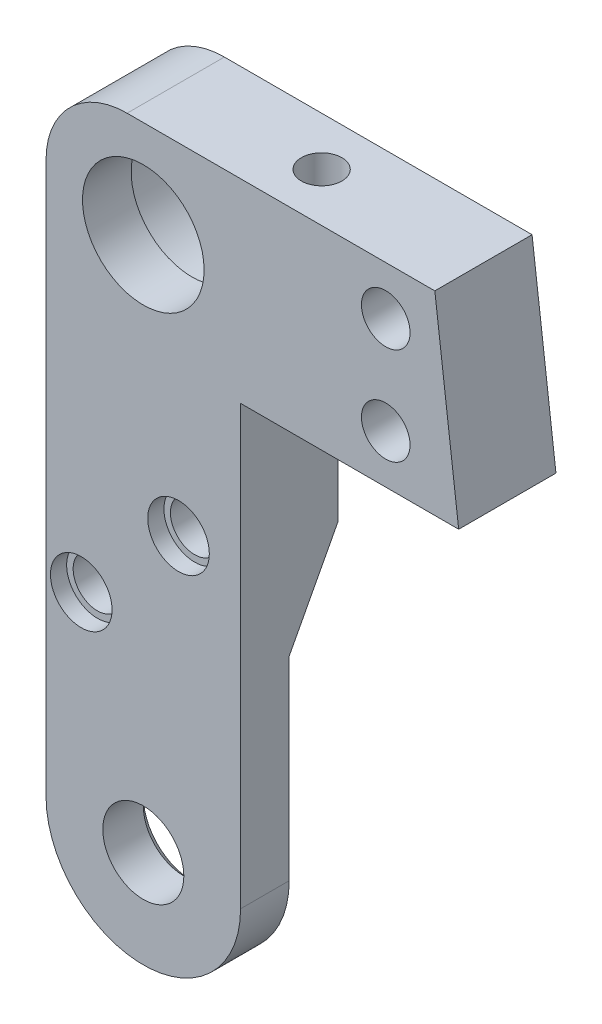
ISO-10303-21;
HEADER;
FILE_DESCRIPTION(('STEP AP214'),'2;1');
FILE_NAME('part.step','',(''),(''),'','','');
FILE_SCHEMA(('AUTOMOTIVE_DESIGN { 1 0 10303 214 1 1 1 1 }'));
ENDSEC;
DATA;
#1=APPLICATION_CONTEXT('core data for automotive mechanical design processes');
#2=APPLICATION_PROTOCOL_DEFINITION('international standard','automotive_design',2000,#1);
#3=PRODUCT_CONTEXT('',#1,'mechanical');
#4=PRODUCT('Part','Part','',(#3));
#5=PRODUCT_RELATED_PRODUCT_CATEGORY('part','',(#4));
#6=PRODUCT_DEFINITION_FORMATION('','',#4);
#7=PRODUCT_DEFINITION_CONTEXT('part definition',#1,'design');
#8=PRODUCT_DEFINITION('design','',#6,#7);
#9=PRODUCT_DEFINITION_SHAPE('','',#8);
#10=(LENGTH_UNIT() NAMED_UNIT(*) SI_UNIT(.MILLI.,.METRE.));
#11=(NAMED_UNIT(*) PLANE_ANGLE_UNIT() SI_UNIT($,.RADIAN.));
#12=(NAMED_UNIT(*) SI_UNIT($,.STERADIAN.) SOLID_ANGLE_UNIT());
#13=UNCERTAINTY_MEASURE_WITH_UNIT(LENGTH_MEASURE(1.E-05),#10,'distance_accuracy_value','');
#14=(GEOMETRIC_REPRESENTATION_CONTEXT(3) GLOBAL_UNCERTAINTY_ASSIGNED_CONTEXT((#13)) GLOBAL_UNIT_ASSIGNED_CONTEXT((#10,
#11,#12)) REPRESENTATION_CONTEXT('',''));
#15=CARTESIAN_POINT('',(0.,0.,0.));
#16=DIRECTION('',(0.,0.,1.));
#17=DIRECTION('',(1.,0.,0.));
#18=AXIS2_PLACEMENT_3D('',#15,#16,#17);
#19=CARTESIAN_POINT('',(-3.82842712474619,18.,12.001));
#20=DIRECTION('',(0.,0.,-1.));
#21=DIRECTION('',(-1.,0.,0.));
#22=AXIS2_PLACEMENT_3D('',#19,#20,#21);
#23=CYLINDRICAL_SURFACE('',#22,1.5);
#24=CARTESIAN_POINT('',(-3.82842712474619,18.,6.75000000000001));
#25=DIRECTION('',(0.,0.,-1.));
#26=DIRECTION('',(-1.,0.,0.));
#27=AXIS2_PLACEMENT_3D('',#24,#25,#26);
#28=CIRCLE('',#27,1.5);
#29=CARTESIAN_POINT('',(-5.32842712474619,18.,6.75000000000001));
#30=VERTEX_POINT('',#29);
#31=EDGE_CURVE('E216',#30,#30,#28,.T.);
#32=ORIENTED_EDGE('',*,*,#31,.T.);
#33=EDGE_LOOP('',(#32));
#34=FACE_BOUND('',#33,.T.);
#35=CARTESIAN_POINT('',(-3.82842712474619,18.,11.));
#36=DIRECTION('',(0.,0.,1.));
#37=DIRECTION('',(1.,0.,0.));
#38=AXIS2_PLACEMENT_3D('',#35,#36,#37);
#39=CIRCLE('',#38,1.5);
#40=CARTESIAN_POINT('',(-2.32842712474619,18.,11.));
#41=VERTEX_POINT('',#40);
#42=EDGE_CURVE('E39',#41,#41,#39,.F.);
#43=ORIENTED_EDGE('',*,*,#42,.F.);
#44=EDGE_LOOP('',(#43));
#45=FACE_BOUND('',#44,.T.);
#46=ADVANCED_FACE('F35',(#34,#45),#23,.F.);
#47=CARTESIAN_POINT('',(2.17157287525381,24.,12.001));
#48=DIRECTION('',(0.,0.,-1.));
#49=DIRECTION('',(-1.,0.,0.));
#50=AXIS2_PLACEMENT_3D('',#47,#48,#49);
#51=CYLINDRICAL_SURFACE('',#50,1.5);
#52=CARTESIAN_POINT('',(2.17157287525381,24.,6.75000000000001));
#53=DIRECTION('',(0.,0.,-1.));
#54=DIRECTION('',(-1.,0.,0.));
#55=AXIS2_PLACEMENT_3D('',#52,#53,#54);
#56=CIRCLE('',#55,1.5);
#57=CARTESIAN_POINT('',(0.671572875253809,24.,6.75000000000001));
#58=VERTEX_POINT('',#57);
#59=EDGE_CURVE('E199',#58,#58,#56,.T.);
#60=ORIENTED_EDGE('',*,*,#59,.T.);
#61=EDGE_LOOP('',(#60));
#62=FACE_BOUND('',#61,.T.);
#63=CARTESIAN_POINT('',(2.17157287525381,24.,11.));
#64=DIRECTION('',(0.,0.,1.));
#65=DIRECTION('',(1.,0.,0.));
#66=AXIS2_PLACEMENT_3D('',#63,#64,#65);
#67=CIRCLE('',#66,1.5);
#68=CARTESIAN_POINT('',(3.67157287525381,24.,11.));
#69=VERTEX_POINT('',#68);
#70=EDGE_CURVE('E378',#69,#69,#67,.F.);
#71=ORIENTED_EDGE('',*,*,#70,.F.);
#72=EDGE_LOOP('',(#71));
#73=FACE_BOUND('',#72,.T.);
#74=ADVANCED_FACE('F285',(#62,#73),#51,.F.);
#75=CARTESIAN_POINT('',(-1.65685424949238,16.,6.));
#76=DIRECTION('',(0.,0.,-1.));
#77=DIRECTION('',(1.,0.,0.));
#78=AXIS2_PLACEMENT_3D('',#75,#76,#77);
#79=PLANE('',#78);
#80=CARTESIAN_POINT('',(2.17157287525381,24.,6.));
#81=DIRECTION('',(0.,0.,-1.));
#82=DIRECTION('',(-1.,0.,0.));
#83=AXIS2_PLACEMENT_3D('',#80,#81,#82);
#84=CIRCLE('',#83,2.25);
#85=CARTESIAN_POINT('',(-0.0784271247461907,24.,6.));
#86=VERTEX_POINT('',#85);
#87=EDGE_CURVE('E213',#86,#86,#84,.F.);
#88=ORIENTED_EDGE('',*,*,#87,.T.);
#89=EDGE_LOOP('',(#88));
#90=FACE_BOUND('',#89,.T.);
#91=CARTESIAN_POINT('',(0.,39.,6.));
#92=DIRECTION('',(0.,0.,1.));
#93=DIRECTION('',(1.,0.,0.));
#94=AXIS2_PLACEMENT_3D('',#91,#92,#93);
#95=CIRCLE('',#94,4.5);
#96=CARTESIAN_POINT('',(4.5,39.,6.));
#97=VERTEX_POINT('',#96);
#98=EDGE_CURVE('E162',#97,#97,#95,.T.);
#99=ORIENTED_EDGE('',*,*,#98,.T.);
#100=EDGE_LOOP('',(#99));
#101=FACE_BOUND('',#100,.T.);
#102=CARTESIAN_POINT('',(14.9545389109916,42.0000000000002,6.));
#103=DIRECTION('',(0.,0.,-1.));
#104=DIRECTION('',(-1.,0.,0.));
#105=AXIS2_PLACEMENT_3D('',#102,#103,#104);
#106=CIRCLE('',#105,1.5);
#107=CARTESIAN_POINT('',(13.4545389109916,42.0000000000002,6.));
#108=VERTEX_POINT('',#107);
#109=EDGE_CURVE('E355',#108,#108,#106,.F.);
#110=ORIENTED_EDGE('',*,*,#109,.T.);
#111=EDGE_LOOP('',(#110));
#112=FACE_BOUND('',#111,.T.);
#113=CARTESIAN_POINT('',(14.9545389109916,36.0000000000002,6.));
#114=DIRECTION('',(0.,0.,-1.));
#115=DIRECTION('',(-1.,0.,0.));
#116=AXIS2_PLACEMENT_3D('',#113,#114,#115);
#117=CIRCLE('',#116,1.5);
#118=CARTESIAN_POINT('',(13.4545389109916,36.0000000000002,6.));
#119=VERTEX_POINT('',#118);
#120=EDGE_CURVE('E373',#119,#119,#117,.F.);
#121=ORIENTED_EDGE('',*,*,#120,.T.);
#122=EDGE_LOOP('',(#121));
#123=FACE_BOUND('',#122,.T.);
#124=DIRECTION('',(1.,0.,0.));
#125=VECTOR('',#124,1.);
#126=CARTESIAN_POINT('',(-1.6568542494924,16.,6.));
#127=LINE('',#126,#125);
#128=CARTESIAN_POINT('',(-2.79765071834178,16.,6.));
#129=VERTEX_POINT('',#128);
#130=CARTESIAN_POINT('',(-1.65685424949238,16.,6.));
#131=VERTEX_POINT('',#130);
#132=EDGE_CURVE('E191',#129,#131,#127,.T.);
#133=ORIENTED_EDGE('',*,*,#132,.F.);
#134=CARTESIAN_POINT('',(-3.82842712474619,18.,6.));
#135=DIRECTION('',(0.,0.,-1.));
#136=DIRECTION('',(-1.,0.,0.));
#137=AXIS2_PLACEMENT_3D('',#134,#135,#136);
#138=CIRCLE('',#137,2.25);
#139=CARTESIAN_POINT('',(-6.,18.5888728618827,6.));
#140=VERTEX_POINT('',#139);
#141=EDGE_CURVE('E211',#129,#140,#138,.F.);
#142=ORIENTED_EDGE('',*,*,#141,.T.);
#143=DIRECTION('',(0.,-1.,0.));
#144=VECTOR('',#143,1.);
#145=CARTESIAN_POINT('',(-6.,40.,6.));
#146=LINE('',#145,#144);
#147=CARTESIAN_POINT('',(-6.,40.,6.));
#148=VERTEX_POINT('',#147);
#149=EDGE_CURVE('E173',#148,#140,#146,.T.);
#150=ORIENTED_EDGE('',*,*,#149,.F.);
#151=CARTESIAN_POINT('',(-1.,40.,6.));
#152=DIRECTION('',(0.,0.,1.));
#153=DIRECTION('',(1.,0.,0.));
#154=AXIS2_PLACEMENT_3D('',#151,#152,#153);
#155=CIRCLE('',#154,5.);
#156=CARTESIAN_POINT('',(-0.999999999999966,45.,6.));
#157=VERTEX_POINT('',#156);
#158=EDGE_CURVE('E169',#157,#148,#155,.T.);
#159=ORIENTED_EDGE('',*,*,#158,.F.);
#160=DIRECTION('',(-1.,0.,0.));
#161=VECTOR('',#160,1.);
#162=CARTESIAN_POINT('',(17.9811241801567,45.,6.));
#163=LINE('',#162,#161);
#164=CARTESIAN_POINT('',(17.9811241801567,45.,6.));
#165=VERTEX_POINT('',#164);
#166=EDGE_CURVE('E166',#165,#157,#163,.T.);
#167=ORIENTED_EDGE('',*,*,#166,.F.);
#168=DIRECTION('',(-0.121869343405148,0.992546151641322,0.));
#169=VECTOR('',#168,1.);
#170=CARTESIAN_POINT('',(19.4545389109915,33.,6.));
#171=LINE('',#170,#169);
#172=CARTESIAN_POINT('',(19.4545389109915,33.,6.));
#173=VERTEX_POINT('',#172);
#174=EDGE_CURVE('E137',#173,#165,#171,.T.);
#175=ORIENTED_EDGE('',*,*,#174,.F.);
#176=DIRECTION('',(1.,0.,0.));
#177=VECTOR('',#176,1.);
#178=CARTESIAN_POINT('',(6.,33.,6.));
#179=LINE('',#178,#177);
#180=CARTESIAN_POINT('',(6.,33.,6.));
#181=VERTEX_POINT('',#180);
#182=EDGE_CURVE('E129',#181,#173,#179,.T.);
#183=ORIENTED_EDGE('',*,*,#182,.F.);
#184=DIRECTION('',(0.,1.,0.));
#185=VECTOR('',#184,1.);
#186=CARTESIAN_POINT('',(6.,33.,6.));
#187=LINE('',#186,#185);
#188=CARTESIAN_POINT('',(6.,23.6568542494924,6.));
#189=VERTEX_POINT('',#188);
#190=EDGE_CURVE('E135',#189,#181,#187,.T.);
#191=ORIENTED_EDGE('',*,*,#190,.F.);
#192=DIRECTION('',(0.707106781186547,0.707106781186548,0.));
#193=VECTOR('',#192,1.);
#194=CARTESIAN_POINT('',(3.1715728752538,20.8284271247462,6.));
#195=LINE('',#194,#193);
#196=EDGE_CURVE('E190',#131,#189,#195,.T.);
#197=ORIENTED_EDGE('',*,*,#196,.F.);
#198=EDGE_LOOP('',(#133,#142,#150,#159,#167,#175,#183,#191,#197));
#199=FACE_BOUND('',#198,.T.);
#200=ADVANCED_FACE('F132',(#90,#101,#112,#123,#199),#79,.T.);
#201=CARTESIAN_POINT('',(0.,39.,9.));
#202=DIRECTION('',(0.,0.,1.));
#203=DIRECTION('',(-1.,0.,0.));
#204=AXIS2_PLACEMENT_3D('',#201,#202,#203);
#205=CYLINDRICAL_SURFACE('',#204,4.5);
#206=ORIENTED_EDGE('',*,*,#98,.F.);
#207=EDGE_LOOP('',(#206));
#208=FACE_BOUND('',#207,.T.);
#209=CARTESIAN_POINT('',(0.,39.,9.));
#210=DIRECTION('',(0.,0.,1.));
#211=DIRECTION('',(1.,0.,0.));
#212=AXIS2_PLACEMENT_3D('',#209,#210,#211);
#213=CIRCLE('',#212,4.5);
#214=CARTESIAN_POINT('',(4.5,39.,9.));
#215=VERTEX_POINT('',#214);
#216=EDGE_CURVE('E353',#215,#215,#213,.T.);
#217=ORIENTED_EDGE('',*,*,#216,.T.);
#218=EDGE_LOOP('',(#217));
#219=FACE_BOUND('',#218,.T.);
#220=ADVANCED_FACE('F245',(#208,#219),#205,.F.);
#221=CARTESIAN_POINT('',(17.9811241801567,45.,9.));
#222=DIRECTION('',(0.,-1.,0.));
#223=DIRECTION('',(0.,0.,1.));
#224=AXIS2_PLACEMENT_3D('',#221,#222,#223);
#225=PLANE('',#224);
#226=DIRECTION('',(-1.,0.,0.));
#227=VECTOR('',#226,1.);
#228=CARTESIAN_POINT('',(17.9811241801567,45.,12.));
#229=LINE('',#228,#227);
#230=CARTESIAN_POINT('',(17.9811241801567,45.,12.));
#231=VERTEX_POINT('',#230);
#232=CARTESIAN_POINT('',(-0.999999999999966,45.,12.));
#233=VERTEX_POINT('',#232);
#234=EDGE_CURVE('E446',#231,#233,#229,.T.);
#235=ORIENTED_EDGE('',*,*,#234,.F.);
#236=DIRECTION('',(0.,0.,1.));
#237=VECTOR('',#236,1.);
#238=CARTESIAN_POINT('',(17.9811241801567,45.,9.));
#239=LINE('',#238,#237);
#240=EDGE_CURVE('E463',#165,#231,#239,.T.);
#241=ORIENTED_EDGE('',*,*,#240,.F.);
#242=ORIENTED_EDGE('',*,*,#166,.T.);
#243=DIRECTION('',(0.,0.,1.));
#244=VECTOR('',#243,1.);
#245=CARTESIAN_POINT('',(-0.999999999999966,45.,9.));
#246=LINE('',#245,#244);
#247=EDGE_CURVE('E461',#157,#233,#246,.T.);
#248=ORIENTED_EDGE('',*,*,#247,.T.);
#249=EDGE_LOOP('',(#235,#241,#242,#248));
#250=FACE_BOUND('',#249,.T.);
#251=CARTESIAN_POINT('',(8.00000000000003,45.,9.));
#252=DIRECTION('',(0.,1.,0.));
#253=DIRECTION('',(0.,0.,1.));
#254=AXIS2_PLACEMENT_3D('',#251,#252,#253);
#255=CIRCLE('',#254,1.24999999999999);
#256=CARTESIAN_POINT('',(8.00000000000003,45.,10.25));
#257=VERTEX_POINT('',#256);
#258=EDGE_CURVE('E361',#257,#257,#255,.T.);
#259=ORIENTED_EDGE('',*,*,#258,.F.);
#260=EDGE_LOOP('',(#259));
#261=FACE_BOUND('',#260,.T.);
#262=ADVANCED_FACE('F241',(#250,#261),#225,.F.);
#263=CARTESIAN_POINT('',(0.,6.,9.));
#264=DIRECTION('',(0.,0.,-1.));
#265=DIRECTION('',(1.,0.,0.));
#266=AXIS2_PLACEMENT_3D('',#263,#264,#265);
#267=PLANE('',#266);
#268=CARTESIAN_POINT('',(-1.62196645003831E-13,5.99999999999987,9.));
#269=DIRECTION('',(0.,0.,-1.));
#270=DIRECTION('',(-1.,0.,0.));
#271=AXIS2_PLACEMENT_3D('',#268,#269,#270);
#272=CIRCLE('',#271,3.00000000000026);
#273=CARTESIAN_POINT('',(-3.00000000000042,5.99999999999987,9.));
#274=VERTEX_POINT('',#273);
#275=EDGE_CURVE('E44',#274,#274,#272,.F.);
#276=ORIENTED_EDGE('',*,*,#275,.T.);
#277=EDGE_LOOP('',(#276));
#278=FACE_BOUND('',#277,.T.);
#279=DIRECTION('',(0.707106781186548,0.707106781186548,0.));
#280=VECTOR('',#279,1.);
#281=CARTESIAN_POINT('',(1.17157287525382,13.1715728752538,9.));
#282=LINE('',#281,#280);
#283=CARTESIAN_POINT('',(1.17157287525382,13.1715728752538,9.));
#284=VERTEX_POINT('',#283);
#285=CARTESIAN_POINT('',(6.,18.,9.));
#286=VERTEX_POINT('',#285);
#287=EDGE_CURVE('E156',#284,#286,#282,.T.);
#288=ORIENTED_EDGE('',*,*,#287,.T.);
#289=DIRECTION('',(0.,1.,0.));
#290=VECTOR('',#289,1.);
#291=CARTESIAN_POINT('',(6.,25.,9.));
#292=LINE('',#291,#290);
#293=CARTESIAN_POINT('',(6.,6.,9.));
#294=VERTEX_POINT('',#293);
#295=EDGE_CURVE('E434',#294,#286,#292,.T.);
#296=ORIENTED_EDGE('',*,*,#295,.F.);
#297=CARTESIAN_POINT('',(0.,6.,9.));
#298=DIRECTION('',(0.,0.,1.));
#299=DIRECTION('',(1.,0.,0.));
#300=AXIS2_PLACEMENT_3D('',#297,#298,#299);
#301=CIRCLE('',#300,6.);
#302=CARTESIAN_POINT('',(-6.,6.,9.));
#303=VERTEX_POINT('',#302);
#304=EDGE_CURVE('E181',#303,#294,#301,.T.);
#305=ORIENTED_EDGE('',*,*,#304,.F.);
#306=DIRECTION('',(0.,-1.,0.));
#307=VECTOR('',#306,1.);
#308=CARTESIAN_POINT('',(-6.,40.,9.));
#309=LINE('',#308,#307);
#310=CARTESIAN_POINT('',(-6.,12.,9.));
#311=VERTEX_POINT('',#310);
#312=EDGE_CURVE('E436',#311,#303,#309,.T.);
#313=ORIENTED_EDGE('',*,*,#312,.F.);
#314=DIRECTION('',(1.,0.,0.));
#315=VECTOR('',#314,1.);
#316=CARTESIAN_POINT('',(-6.,12.,9.));
#317=LINE('',#316,#315);
#318=CARTESIAN_POINT('',(-1.6568542494924,12.,9.));
#319=VERTEX_POINT('',#318);
#320=EDGE_CURVE('E178',#311,#319,#317,.T.);
#321=ORIENTED_EDGE('',*,*,#320,.T.);
#322=CARTESIAN_POINT('',(-1.65685424949238,16.,9.));
#323=DIRECTION('',(0.,0.,1.));
#324=DIRECTION('',(1.,0.,0.));
#325=AXIS2_PLACEMENT_3D('',#322,#323,#324);
#326=CIRCLE('',#325,4.);
#327=EDGE_CURVE('E159',#319,#284,#326,.T.);
#328=ORIENTED_EDGE('',*,*,#327,.T.);
#329=EDGE_LOOP('',(#288,#296,#305,#313,#321,#328));
#330=FACE_BOUND('',#329,.T.);
#331=ADVANCED_FACE('F244',(#278,#330),#267,.T.);
#332=CARTESIAN_POINT('',(0.,6.,12.));
#333=DIRECTION('',(0.,0.,-1.));
#334=DIRECTION('',(1.,0.,0.));
#335=AXIS2_PLACEMENT_3D('',#332,#333,#334);
#336=PLANE('',#335);
#337=CARTESIAN_POINT('',(-3.82842712474619,18.,12.));
#338=DIRECTION('',(0.,0.,1.));
#339=DIRECTION('',(1.,0.,0.));
#340=AXIS2_PLACEMENT_3D('',#337,#338,#339);
#341=CIRCLE('',#340,1.9);
#342=CARTESIAN_POINT('',(-1.92842712474619,18.,12.));
#343=VERTEX_POINT('',#342);
#344=EDGE_CURVE('E327',#343,#343,#341,.T.);
#345=ORIENTED_EDGE('',*,*,#344,.F.);
#346=EDGE_LOOP('',(#345));
#347=FACE_BOUND('',#346,.T.);
#348=CARTESIAN_POINT('',(2.17157287525381,24.,12.));
#349=DIRECTION('',(0.,0.,1.));
#350=DIRECTION('',(1.,0.,0.));
#351=AXIS2_PLACEMENT_3D('',#348,#349,#350);
#352=CIRCLE('',#351,1.9);
#353=CARTESIAN_POINT('',(4.07157287525381,24.,12.));
#354=VERTEX_POINT('',#353);
#355=EDGE_CURVE('E331',#354,#354,#352,.T.);
#356=ORIENTED_EDGE('',*,*,#355,.F.);
#357=EDGE_LOOP('',(#356));
#358=FACE_BOUND('',#357,.T.);
#359=CARTESIAN_POINT('',(-1.62196645003831E-13,5.99999999999987,12.));
#360=DIRECTION('',(0.,0.,1.));
#361=DIRECTION('',(1.,0.,0.));
#362=AXIS2_PLACEMENT_3D('',#359,#360,#361);
#363=CIRCLE('',#362,2.50000000000026);
#364=CARTESIAN_POINT('',(2.50000000000009,5.99999999999987,12.));
#365=VERTEX_POINT('',#364);
#366=EDGE_CURVE('E335',#365,#365,#363,.T.);
#367=ORIENTED_EDGE('',*,*,#366,.F.);
#368=EDGE_LOOP('',(#367));
#369=FACE_BOUND('',#368,.T.);
#370=CARTESIAN_POINT('',(14.9545389109916,36.0000000000002,12.));
#371=DIRECTION('',(0.,0.,1.));
#372=DIRECTION('',(1.,0.,0.));
#373=AXIS2_PLACEMENT_3D('',#370,#371,#372);
#374=CIRCLE('',#373,1.5);
#375=CARTESIAN_POINT('',(16.4545389109916,36.0000000000002,12.));
#376=VERTEX_POINT('',#375);
#377=EDGE_CURVE('E339',#376,#376,#374,.T.);
#378=ORIENTED_EDGE('',*,*,#377,.F.);
#379=EDGE_LOOP('',(#378));
#380=FACE_BOUND('',#379,.T.);
#381=CARTESIAN_POINT('',(14.9545389109916,42.0000000000002,12.));
#382=DIRECTION('',(0.,0.,1.));
#383=DIRECTION('',(1.,0.,0.));
#384=AXIS2_PLACEMENT_3D('',#381,#382,#383);
#385=CIRCLE('',#384,1.5);
#386=CARTESIAN_POINT('',(16.4545389109916,42.0000000000002,12.));
#387=VERTEX_POINT('',#386);
#388=EDGE_CURVE('E343',#387,#387,#385,.T.);
#389=ORIENTED_EDGE('',*,*,#388,.F.);
#390=EDGE_LOOP('',(#389));
#391=FACE_BOUND('',#390,.T.);
#392=DIRECTION('',(0.,1.,0.));
#393=VECTOR('',#392,1.);
#394=CARTESIAN_POINT('',(6.,33.,12.));
#395=LINE('',#394,#393);
#396=CARTESIAN_POINT('',(6.,6.,12.));
#397=VERTEX_POINT('',#396);
#398=CARTESIAN_POINT('',(6.,33.,12.));
#399=VERTEX_POINT('',#398);
#400=EDGE_CURVE('E175',#397,#399,#395,.T.);
#401=ORIENTED_EDGE('',*,*,#400,.T.);
#402=DIRECTION('',(1.,0.,0.));
#403=VECTOR('',#402,1.);
#404=CARTESIAN_POINT('',(19.4545389109915,33.,12.));
#405=LINE('',#404,#403);
#406=CARTESIAN_POINT('',(19.4545389109915,33.,12.));
#407=VERTEX_POINT('',#406);
#408=EDGE_CURVE('E145',#399,#407,#405,.T.);
#409=ORIENTED_EDGE('',*,*,#408,.T.);
#410=DIRECTION('',(-0.121869343405148,0.992546151641322,0.));
#411=VECTOR('',#410,1.);
#412=CARTESIAN_POINT('',(17.9811241801567,45.,12.));
#413=LINE('',#412,#411);
#414=EDGE_CURVE('E443',#407,#231,#413,.T.);
#415=ORIENTED_EDGE('',*,*,#414,.T.);
#416=ORIENTED_EDGE('',*,*,#234,.T.);
#417=CARTESIAN_POINT('',(-1.,40.,12.));
#418=DIRECTION('',(0.,0.,1.));
#419=DIRECTION('',(-1.,0.,0.));
#420=AXIS2_PLACEMENT_3D('',#417,#418,#419);
#421=CIRCLE('',#420,5.);
#422=CARTESIAN_POINT('',(-6.,40.,12.));
#423=VERTEX_POINT('',#422);
#424=EDGE_CURVE('E449',#233,#423,#421,.T.);
#425=ORIENTED_EDGE('',*,*,#424,.T.);
#426=DIRECTION('',(0.,-1.,0.));
#427=VECTOR('',#426,1.);
#428=CARTESIAN_POINT('',(-6.,6.,12.));
#429=LINE('',#428,#427);
#430=CARTESIAN_POINT('',(-6.,6.,12.));
#431=VERTEX_POINT('',#430);
#432=EDGE_CURVE('E452',#423,#431,#429,.T.);
#433=ORIENTED_EDGE('',*,*,#432,.T.);
#434=CARTESIAN_POINT('',(0.,6.,12.));
#435=DIRECTION('',(0.,0.,1.));
#436=DIRECTION('',(1.,0.,0.));
#437=AXIS2_PLACEMENT_3D('',#434,#435,#436);
#438=CIRCLE('',#437,6.);
#439=EDGE_CURVE('E455',#431,#397,#438,.T.);
#440=ORIENTED_EDGE('',*,*,#439,.T.);
#441=EDGE_LOOP('',(#401,#409,#415,#416,#425,#433,#440));
#442=FACE_BOUND('',#441,.T.);
#443=CARTESIAN_POINT('',(0.,39.,12.));
#444=DIRECTION('',(0.,0.,1.));
#445=DIRECTION('',(1.,0.,0.));
#446=AXIS2_PLACEMENT_3D('',#443,#444,#445);
#447=CIRCLE('',#446,3.75);
#448=CARTESIAN_POINT('',(3.75,39.,12.));
#449=VERTEX_POINT('',#448);
#450=EDGE_CURVE('E348',#449,#449,#447,.T.);
#451=ORIENTED_EDGE('',*,*,#450,.F.);
#452=EDGE_LOOP('',(#451));
#453=FACE_BOUND('',#452,.T.);
#454=ADVANCED_FACE('F255',(#347,#358,#369,#380,#391,#442,#453),#336,.F.);
#455=CARTESIAN_POINT('',(6.,33.,9.));
#456=DIRECTION('',(-1.,0.,0.));
#457=DIRECTION('',(0.,0.,-1.));
#458=AXIS2_PLACEMENT_3D('',#455,#456,#457);
#459=PLANE('',#458);
#460=ORIENTED_EDGE('',*,*,#190,.T.);
#461=DIRECTION('',(0.,0.,1.));
#462=VECTOR('',#461,1.);
#463=CARTESIAN_POINT('',(6.,33.,9.));
#464=LINE('',#463,#462);
#465=EDGE_CURVE('E142',#181,#399,#464,.T.);
#466=ORIENTED_EDGE('',*,*,#465,.T.);
#467=ORIENTED_EDGE('',*,*,#400,.F.);
#468=DIRECTION('',(0.,0.,1.));
#469=VECTOR('',#468,1.);
#470=CARTESIAN_POINT('',(6.,6.,9.));
#471=LINE('',#470,#469);
#472=EDGE_CURVE('E149',#294,#397,#471,.T.);
#473=ORIENTED_EDGE('',*,*,#472,.F.);
#474=ORIENTED_EDGE('',*,*,#295,.T.);
#475=DIRECTION('',(0.,-0.883452208598773,0.468521285665818));
#476=VECTOR('',#475,1.);
#477=CARTESIAN_POINT('',(6.,17.6807728840349,9.16929574382816));
#478=LINE('',#477,#476);
#479=EDGE_CURVE('E155',#189,#286,#478,.T.);
#480=ORIENTED_EDGE('',*,*,#479,.F.);
#481=EDGE_LOOP('',(#460,#466,#467,#473,#474,#480));
#482=FACE_BOUND('',#481,.T.);
#483=ADVANCED_FACE('F153',(#482),#459,.F.);
#484=CARTESIAN_POINT('',(19.4545389109915,33.,9.));
#485=DIRECTION('',(0.,1.,0.));
#486=DIRECTION('',(0.,0.,-1.));
#487=AXIS2_PLACEMENT_3D('',#484,#485,#486);
#488=PLANE('',#487);
#489=CARTESIAN_POINT('',(8.00000000000003,33.,9.));
#490=DIRECTION('',(0.,1.,0.));
#491=DIRECTION('',(0.,0.,1.));
#492=AXIS2_PLACEMENT_3D('',#489,#490,#491);
#493=CIRCLE('',#492,1.24999999999999);
#494=CARTESIAN_POINT('',(8.00000000000003,33.,10.25));
#495=VERTEX_POINT('',#494);
#496=EDGE_CURVE('E205',#495,#495,#493,.T.);
#497=ORIENTED_EDGE('',*,*,#496,.T.);
#498=EDGE_LOOP('',(#497));
#499=FACE_BOUND('',#498,.T.);
#500=ORIENTED_EDGE('',*,*,#408,.F.);
#501=ORIENTED_EDGE('',*,*,#465,.F.);
#502=ORIENTED_EDGE('',*,*,#182,.T.);
#503=DIRECTION('',(0.,0.,1.));
#504=VECTOR('',#503,1.);
#505=CARTESIAN_POINT('',(19.4545389109915,33.,9.));
#506=LINE('',#505,#504);
#507=EDGE_CURVE('E150',#173,#407,#506,.T.);
#508=ORIENTED_EDGE('',*,*,#507,.T.);
#509=EDGE_LOOP('',(#500,#501,#502,#508));
#510=FACE_BOUND('',#509,.T.);
#511=ADVANCED_FACE('F143',(#499,#510),#488,.F.);
#512=CARTESIAN_POINT('',(17.9811241801567,45.,9.));
#513=DIRECTION('',(-0.992546151641322,-0.121869343405148,0.));
#514=DIRECTION('',(0.121869343405148,-0.992546151641322,0.));
#515=AXIS2_PLACEMENT_3D('',#512,#513,#514);
#516=PLANE('',#515);
#517=ORIENTED_EDGE('',*,*,#414,.F.);
#518=ORIENTED_EDGE('',*,*,#507,.F.);
#519=ORIENTED_EDGE('',*,*,#174,.T.);
#520=ORIENTED_EDGE('',*,*,#240,.T.);
#521=EDGE_LOOP('',(#517,#518,#519,#520));
#522=FACE_BOUND('',#521,.T.);
#523=ADVANCED_FACE('F239',(#522),#516,.F.);
#524=CARTESIAN_POINT('',(-1.,40.,9.));
#525=DIRECTION('',(0.,0.,1.));
#526=DIRECTION('',(-1.,0.,0.));
#527=AXIS2_PLACEMENT_3D('',#524,#525,#526);
#528=CYLINDRICAL_SURFACE('',#527,5.);
#529=ORIENTED_EDGE('',*,*,#424,.F.);
#530=ORIENTED_EDGE('',*,*,#247,.F.);
#531=ORIENTED_EDGE('',*,*,#158,.T.);
#532=DIRECTION('',(0.,0.,1.));
#533=VECTOR('',#532,1.);
#534=CARTESIAN_POINT('',(-6.,40.,9.));
#535=LINE('',#534,#533);
#536=EDGE_CURVE('E459',#148,#423,#535,.T.);
#537=ORIENTED_EDGE('',*,*,#536,.T.);
#538=EDGE_LOOP('',(#529,#530,#531,#537));
#539=FACE_BOUND('',#538,.T.);
#540=ADVANCED_FACE('F235',(#539),#528,.T.);
#541=CARTESIAN_POINT('',(-6.,6.,9.));
#542=DIRECTION('',(1.,0.,0.));
#543=DIRECTION('',(0.,0.,1.));
#544=AXIS2_PLACEMENT_3D('',#541,#542,#543);
#545=PLANE('',#544);
#546=ORIENTED_EDGE('',*,*,#149,.T.);
#547=CARTESIAN_POINT('',(-6.,18.5888728618827,6.));
#548=CARTESIAN_POINT('',(-6.,18.5345506133327,6.01423517824827));
#549=CARTESIAN_POINT('',(-6.,18.4797490979824,6.02672873719174));
#550=CARTESIAN_POINT('',(-6.,18.3693745884175,6.0478982762256));
#551=CARTESIAN_POINT('',(-6.,18.3138010486737,6.0565713986462));
#552=CARTESIAN_POINT('',(-6.,18.2032259608564,6.0696166614975));
#553=CARTESIAN_POINT('',(-6.,18.1482339947835,6.07406838030421));
#554=CARTESIAN_POINT('',(-6.,18.0381027570336,6.07879044433208));
#555=CARTESIAN_POINT('',(-6.,17.9829635638828,6.0790626936418));
#556=CARTESIAN_POINT('',(-6.,17.8413398295595,6.07435036934561));
#557=CARTESIAN_POINT('',(-6.,17.7549357709992,6.06627520255906));
#558=CARTESIAN_POINT('',(-6.,17.6258250953234,6.04685000211514));
#559=CARTESIAN_POINT('',(-6.,17.5825354572563,6.03906612957967));
#560=CARTESIAN_POINT('',(-6.,17.4964490995034,6.02120589974116));
#561=CARTESIAN_POINT('',(-6.,17.453652180958,6.01113050398681));
#562=CARTESIAN_POINT('',(-6.,17.4111271381173,6.));
#563=B_SPLINE_CURVE_WITH_KNOTS('',3,(#547,#548,#549,#550,#551,#552,#553,#554,#555,#556,#557,
#558,#559,#560,#561,#562),.UNSPECIFIED.,.F.,.F.,(4,2,2,2,2,2,2,4),(0.,0.168473575185644,
0.33707295476046,0.502426863996649,0.667705438831224,0.927363508061776,1.05926472910832,
1.19111070471259),.UNSPECIFIED.);
#564=CARTESIAN_POINT('',(-6.,17.4111271381173,6.));
#565=VERTEX_POINT('',#564);
#566=EDGE_CURVE('E52',#140,#565,#563,.T.);
#567=ORIENTED_EDGE('',*,*,#566,.T.);
#568=CARTESIAN_POINT('',(-6.,16.,6.));
#569=VERTEX_POINT('',#568);
#570=EDGE_CURVE('E172',#565,#569,#146,.T.);
#571=ORIENTED_EDGE('',*,*,#570,.T.);
#572=DIRECTION('',(0.,0.8,-0.6));
#573=VECTOR('',#572,1.);
#574=CARTESIAN_POINT('',(-6.,16.,6.));
#575=LINE('',#574,#573);
#576=EDGE_CURVE('E194',#311,#569,#575,.T.);
#577=ORIENTED_EDGE('',*,*,#576,.F.);
#578=ORIENTED_EDGE('',*,*,#312,.T.);
#579=DIRECTION('',(0.,0.,1.));
#580=VECTOR('',#579,1.);
#581=CARTESIAN_POINT('',(-6.,6.,9.));
#582=LINE('',#581,#580);
#583=EDGE_CURVE('E457',#303,#431,#582,.T.);
#584=ORIENTED_EDGE('',*,*,#583,.T.);
#585=ORIENTED_EDGE('',*,*,#432,.F.);
#586=ORIENTED_EDGE('',*,*,#536,.F.);
#587=EDGE_LOOP('',(#546,#567,#571,#577,#578,#584,#585,#586));
#588=FACE_BOUND('',#587,.T.);
#589=ADVANCED_FACE('F229',(#588),#545,.F.);
#590=CARTESIAN_POINT('',(0.,6.,9.));
#591=DIRECTION('',(0.,0.,1.));
#592=DIRECTION('',(-1.,0.,0.));
#593=AXIS2_PLACEMENT_3D('',#590,#591,#592);
#594=CYLINDRICAL_SURFACE('',#593,6.);
#595=ORIENTED_EDGE('',*,*,#439,.F.);
#596=ORIENTED_EDGE('',*,*,#583,.F.);
#597=ORIENTED_EDGE('',*,*,#304,.T.);
#598=ORIENTED_EDGE('',*,*,#472,.T.);
#599=EDGE_LOOP('',(#595,#596,#597,#598));
#600=FACE_BOUND('',#599,.T.);
#601=ADVANCED_FACE('F234',(#600),#594,.T.);
#602=ORIENTED_EDGE('',*,*,#570,.F.);
#603=CARTESIAN_POINT('',(-3.82842712474619,18.,6.));
#604=DIRECTION('',(0.,0.,-1.));
#605=DIRECTION('',(-1.,0.,0.));
#606=AXIS2_PLACEMENT_3D('',#603,#604,#605);
#607=CIRCLE('',#606,2.25);
#608=CARTESIAN_POINT('',(-4.8592035311506,16.,6.));
#609=VERTEX_POINT('',#608);
#610=EDGE_CURVE('E209',#565,#609,#607,.F.);
#611=ORIENTED_EDGE('',*,*,#610,.T.);
#612=EDGE_CURVE('E187',#569,#609,#127,.T.);
#613=ORIENTED_EDGE('',*,*,#612,.F.);
#614=EDGE_LOOP('',(#602,#611,#613));
#615=FACE_BOUND('',#614,.T.);
#616=ADVANCED_FACE('F267',(#615),#79,.T.);
#617=CARTESIAN_POINT('',(-1.65685424949238,16.,6.));
#618=DIRECTION('',(0.,-0.6,-0.8));
#619=DIRECTION('',(-1.,0.,0.));
#620=AXIS2_PLACEMENT_3D('',#617,#618,#619);
#621=PLANE('',#620);
#622=ORIENTED_EDGE('',*,*,#612,.T.);
#623=CARTESIAN_POINT('',(-3.82842712474619,24.4285714285713,-0.321428571428426));
#624=DIRECTION('',(0.,-0.6,-0.8));
#625=DIRECTION('',(0.,0.8,-0.6));
#626=AXIS2_PLACEMENT_3D('',#623,#624,#625);
#627=ELLIPSE('',#626,10.7142857142855,5.66946709513834);
#628=EDGE_CURVE('E224',#609,#129,#627,.F.);
#629=ORIENTED_EDGE('',*,*,#628,.T.);
#630=ORIENTED_EDGE('',*,*,#132,.T.);
#631=DIRECTION('',(0.,-0.8,0.6));
#632=VECTOR('',#631,1.);
#633=CARTESIAN_POINT('',(-1.65685424949238,16.,6.));
#634=LINE('',#633,#632);
#635=EDGE_CURVE('E204',#131,#319,#634,.T.);
#636=ORIENTED_EDGE('',*,*,#635,.T.);
#637=ORIENTED_EDGE('',*,*,#320,.F.);
#638=ORIENTED_EDGE('',*,*,#576,.T.);
#639=EDGE_LOOP('',(#622,#629,#630,#636,#637,#638));
#640=FACE_BOUND('',#639,.T.);
#641=ADVANCED_FACE('F264',(#640),#621,.T.);
#642=CARTESIAN_POINT('',(-1.65685424949238,16.,9.00000000000001));
#643=DIRECTION('',(0.,0.,1.));
#644=DIRECTION('',(-1.,0.,0.));
#645=AXIS2_PLACEMENT_3D('',#642,#643,#644);
#646=CONICAL_SURFACE('',#645,4.00000000000002,0.927295218001613);
#647=ORIENTED_EDGE('',*,*,#635,.F.);
#648=DIRECTION('',(0.565685424949238,-0.565685424949238,0.6));
#649=VECTOR('',#648,1.);
#650=CARTESIAN_POINT('',(-1.65685424949238,16.,6.));
#651=LINE('',#650,#649);
#652=EDGE_CURVE('E202',#131,#284,#651,.T.);
#653=ORIENTED_EDGE('',*,*,#652,.T.);
#654=ORIENTED_EDGE('',*,*,#327,.F.);
#655=EDGE_LOOP('',(#647,#653,#654));
#656=FACE_BOUND('',#655,.T.);
#657=ADVANCED_FACE('F260',(#656),#646,.T.);
#658=CARTESIAN_POINT('',(-1.65685424949239,16.,6.));
#659=DIRECTION('',(0.424264068711928,-0.424264068711928,-0.8));
#660=DIRECTION('',(-0.707106781186547,-0.707106781186548,0.));
#661=AXIS2_PLACEMENT_3D('',#658,#659,#660);
#662=PLANE('',#661);
#663=ORIENTED_EDGE('',*,*,#652,.F.);
#664=ORIENTED_EDGE('',*,*,#196,.T.);
#665=ORIENTED_EDGE('',*,*,#479,.T.);
#666=ORIENTED_EDGE('',*,*,#287,.F.);
#667=EDGE_LOOP('',(#663,#664,#665,#666));
#668=FACE_BOUND('',#667,.T.);
#669=ADVANCED_FACE('F256',(#668),#662,.T.);
#670=CARTESIAN_POINT('',(8.00000000000003,45.,9.));
#671=DIRECTION('',(0.,1.,0.));
#672=DIRECTION('',(0.,0.,1.));
#673=AXIS2_PLACEMENT_3D('',#670,#671,#672);
#674=CYLINDRICAL_SURFACE('',#673,1.24999999999999);
#675=ORIENTED_EDGE('',*,*,#496,.F.);
#676=EDGE_LOOP('',(#675));
#677=FACE_BOUND('',#676,.T.);
#678=ORIENTED_EDGE('',*,*,#258,.T.);
#679=EDGE_LOOP('',(#678));
#680=FACE_BOUND('',#679,.T.);
#681=ADVANCED_FACE('F259',(#677,#680),#674,.F.);
#682=CARTESIAN_POINT('',(0.,39.,9.));
#683=DIRECTION('',(0.,0.,1.));
#684=DIRECTION('',(1.,0.,0.));
#685=AXIS2_PLACEMENT_3D('',#682,#683,#684);
#686=PLANE('',#685);
#687=CARTESIAN_POINT('',(0.,39.,9.));
#688=DIRECTION('',(0.,0.,1.));
#689=DIRECTION('',(1.,0.,0.));
#690=AXIS2_PLACEMENT_3D('',#687,#688,#689);
#691=CIRCLE('',#690,3.75);
#692=CARTESIAN_POINT('',(3.75,39.,9.));
#693=VERTEX_POINT('',#692);
#694=EDGE_CURVE('E350',#693,#693,#691,.T.);
#695=ORIENTED_EDGE('',*,*,#694,.T.);
#696=EDGE_LOOP('',(#695));
#697=FACE_BOUND('',#696,.T.);
#698=ORIENTED_EDGE('',*,*,#216,.F.);
#699=EDGE_LOOP('',(#698));
#700=FACE_BOUND('',#699,.T.);
#701=ADVANCED_FACE('F302',(#697,#700),#686,.F.);
#702=CARTESIAN_POINT('',(0.,39.,9.));
#703=DIRECTION('',(0.,0.,1.));
#704=DIRECTION('',(1.,0.,0.));
#705=AXIS2_PLACEMENT_3D('',#702,#703,#704);
#706=CYLINDRICAL_SURFACE('',#705,3.75);
#707=ORIENTED_EDGE('',*,*,#694,.F.);
#708=EDGE_LOOP('',(#707));
#709=FACE_BOUND('',#708,.T.);
#710=ORIENTED_EDGE('',*,*,#450,.T.);
#711=EDGE_LOOP('',(#710));
#712=FACE_BOUND('',#711,.T.);
#713=ADVANCED_FACE('F298',(#709,#712),#706,.F.);
#714=CARTESIAN_POINT('',(14.9545389109916,42.0000000000002,5.998975));
#715=DIRECTION('',(0.,0.,1.));
#716=DIRECTION('',(1.,0.,0.));
#717=AXIS2_PLACEMENT_3D('',#714,#715,#716);
#718=CYLINDRICAL_SURFACE('',#717,1.5);
#719=ORIENTED_EDGE('',*,*,#109,.F.);
#720=EDGE_LOOP('',(#719));
#721=FACE_BOUND('',#720,.T.);
#722=ORIENTED_EDGE('',*,*,#388,.T.);
#723=EDGE_LOOP('',(#722));
#724=FACE_BOUND('',#723,.T.);
#725=ADVANCED_FACE('F279',(#721,#724),#718,.F.);
#726=CARTESIAN_POINT('',(14.9545389109916,36.0000000000002,5.998975));
#727=DIRECTION('',(0.,0.,1.));
#728=DIRECTION('',(1.,0.,0.));
#729=AXIS2_PLACEMENT_3D('',#726,#727,#728);
#730=CYLINDRICAL_SURFACE('',#729,1.5);
#731=ORIENTED_EDGE('',*,*,#120,.F.);
#732=EDGE_LOOP('',(#731));
#733=FACE_BOUND('',#732,.T.);
#734=ORIENTED_EDGE('',*,*,#377,.T.);
#735=EDGE_LOOP('',(#734));
#736=FACE_BOUND('',#735,.T.);
#737=ADVANCED_FACE('F271',(#733,#736),#730,.F.);
#738=CARTESIAN_POINT('',(2.17157287525381,24.,6.75000000000001));
#739=DIRECTION('',(0.,0.,-1.));
#740=DIRECTION('',(-1.,0.,0.));
#741=AXIS2_PLACEMENT_3D('',#738,#739,#740);
#742=CONICAL_SURFACE('',#741,1.5,0.785398163397445);
#743=ORIENTED_EDGE('',*,*,#87,.F.);
#744=EDGE_LOOP('',(#743));
#745=FACE_BOUND('',#744,.T.);
#746=ORIENTED_EDGE('',*,*,#59,.F.);
#747=EDGE_LOOP('',(#746));
#748=FACE_BOUND('',#747,.T.);
#749=ADVANCED_FACE('F269',(#745,#748),#742,.F.);
#750=CARTESIAN_POINT('',(-3.82842712474619,18.,6.75000000000001));
#751=DIRECTION('',(0.,0.,-1.));
#752=DIRECTION('',(-1.,0.,0.));
#753=AXIS2_PLACEMENT_3D('',#750,#751,#752);
#754=CONICAL_SURFACE('',#753,1.5,0.785398163397445);
#755=ORIENTED_EDGE('',*,*,#566,.F.);
#756=ORIENTED_EDGE('',*,*,#141,.F.);
#757=ORIENTED_EDGE('',*,*,#628,.F.);
#758=ORIENTED_EDGE('',*,*,#610,.F.);
#759=EDGE_LOOP('',(#755,#756,#757,#758));
#760=FACE_BOUND('',#759,.T.);
#761=ORIENTED_EDGE('',*,*,#31,.F.);
#762=EDGE_LOOP('',(#761));
#763=FACE_BOUND('',#762,.T.);
#764=ADVANCED_FACE('F226',(#760,#763),#754,.F.);
#765=CARTESIAN_POINT('',(-1.62196645003831E-13,5.99999999999987,5.89988436741288));
#766=DIRECTION('',(0.,0.,1.));
#767=DIRECTION('',(1.,0.,0.));
#768=AXIS2_PLACEMENT_3D('',#765,#766,#767);
#769=CYLINDRICAL_SURFACE('',#768,2.50000000000026);
#770=CARTESIAN_POINT('',(-1.62196645003831E-13,5.99999999999987,9.5));
#771=DIRECTION('',(0.,0.,-1.));
#772=DIRECTION('',(-1.,0.,0.));
#773=AXIS2_PLACEMENT_3D('',#770,#771,#772);
#774=CIRCLE('',#773,2.50000000000026);
#775=CARTESIAN_POINT('',(-2.50000000000042,5.99999999999987,9.5));
#776=VERTEX_POINT('',#775);
#777=EDGE_CURVE('E11',#776,#776,#774,.T.);
#778=ORIENTED_EDGE('',*,*,#777,.T.);
#779=EDGE_LOOP('',(#778));
#780=FACE_BOUND('',#779,.T.);
#781=ORIENTED_EDGE('',*,*,#366,.T.);
#782=EDGE_LOOP('',(#781));
#783=FACE_BOUND('',#782,.T.);
#784=ADVANCED_FACE('F277',(#780,#783),#769,.F.);
#785=CARTESIAN_POINT('',(-1.62196645003831E-13,5.99999999999987,9.));
#786=DIRECTION('',(0.,0.,-1.));
#787=DIRECTION('',(-1.,0.,0.));
#788=AXIS2_PLACEMENT_3D('',#785,#786,#787);
#789=CONICAL_SURFACE('',#788,3.00000000000026,0.78539816339745);
#790=ORIENTED_EDGE('',*,*,#777,.F.);
#791=EDGE_LOOP('',(#790));
#792=FACE_BOUND('',#791,.T.);
#793=ORIENTED_EDGE('',*,*,#275,.F.);
#794=EDGE_LOOP('',(#793));
#795=FACE_BOUND('',#794,.T.);
#796=ADVANCED_FACE('F37',(#792,#795),#789,.F.);
#797=CARTESIAN_POINT('',(2.17157287525381,24.,11.));
#798=DIRECTION('',(0.,0.,1.));
#799=DIRECTION('',(1.,0.,0.));
#800=AXIS2_PLACEMENT_3D('',#797,#798,#799);
#801=PLANE('',#800);
#802=CARTESIAN_POINT('',(2.17157287525381,24.,11.));
#803=DIRECTION('',(0.,0.,1.));
#804=DIRECTION('',(1.,0.,0.));
#805=AXIS2_PLACEMENT_3D('',#802,#803,#804);
#806=CIRCLE('',#805,1.9);
#807=CARTESIAN_POINT('',(4.07157287525381,24.,11.));
#808=VERTEX_POINT('',#807);
#809=EDGE_CURVE('E380',#808,#808,#806,.T.);
#810=ORIENTED_EDGE('',*,*,#809,.T.);
#811=EDGE_LOOP('',(#810));
#812=FACE_BOUND('',#811,.T.);
#813=ORIENTED_EDGE('',*,*,#70,.T.);
#814=EDGE_LOOP('',(#813));
#815=FACE_BOUND('',#814,.T.);
#816=ADVANCED_FACE('F402',(#812,#815),#801,.T.);
#817=CARTESIAN_POINT('',(2.17157287525381,24.,11.));
#818=DIRECTION('',(0.,0.,1.));
#819=DIRECTION('',(1.,0.,0.));
#820=AXIS2_PLACEMENT_3D('',#817,#818,#819);
#821=CYLINDRICAL_SURFACE('',#820,1.9);
#822=ORIENTED_EDGE('',*,*,#809,.F.);
#823=EDGE_LOOP('',(#822));
#824=FACE_BOUND('',#823,.T.);
#825=ORIENTED_EDGE('',*,*,#355,.T.);
#826=EDGE_LOOP('',(#825));
#827=FACE_BOUND('',#826,.T.);
#828=ADVANCED_FACE('F394',(#824,#827),#821,.F.);
#829=CARTESIAN_POINT('',(-3.82842712474619,18.,11.));
#830=DIRECTION('',(0.,0.,1.));
#831=DIRECTION('',(1.,0.,0.));
#832=AXIS2_PLACEMENT_3D('',#829,#830,#831);
#833=PLANE('',#832);
#834=CARTESIAN_POINT('',(-3.82842712474619,18.,11.));
#835=DIRECTION('',(0.,0.,1.));
#836=DIRECTION('',(1.,0.,0.));
#837=AXIS2_PLACEMENT_3D('',#834,#835,#836);
#838=CIRCLE('',#837,1.9);
#839=CARTESIAN_POINT('',(-1.92842712474619,18.,11.));
#840=VERTEX_POINT('',#839);
#841=EDGE_CURVE('E384',#840,#840,#838,.T.);
#842=ORIENTED_EDGE('',*,*,#841,.T.);
#843=EDGE_LOOP('',(#842));
#844=FACE_BOUND('',#843,.T.);
#845=ORIENTED_EDGE('',*,*,#42,.T.);
#846=EDGE_LOOP('',(#845));
#847=FACE_BOUND('',#846,.T.);
#848=ADVANCED_FACE('F391',(#844,#847),#833,.T.);
#849=CARTESIAN_POINT('',(-3.82842712474619,18.,11.));
#850=DIRECTION('',(0.,0.,1.));
#851=DIRECTION('',(1.,0.,0.));
#852=AXIS2_PLACEMENT_3D('',#849,#850,#851);
#853=CYLINDRICAL_SURFACE('',#852,1.9);
#854=ORIENTED_EDGE('',*,*,#841,.F.);
#855=EDGE_LOOP('',(#854));
#856=FACE_BOUND('',#855,.T.);
#857=ORIENTED_EDGE('',*,*,#344,.T.);
#858=EDGE_LOOP('',(#857));
#859=FACE_BOUND('',#858,.T.);
#860=ADVANCED_FACE('F393',(#856,#859),#853,.F.);
#861=CLOSED_SHELL('',(#46,#74,#200,#220,#262,#331,#454,#483,#511,#523,#540,#589,#601,#616,#641,
#657,#669,#681,#701,#713,#725,#737,#749,#764,#784,#796,#816,#828,#848,#860));
#862=MANIFOLD_SOLID_BREP('B2',#861);
#863=ADVANCED_BREP_SHAPE_REPRESENTATION('',(#18,#862),#14);
#864=SHAPE_DEFINITION_REPRESENTATION(#9,#863);
ENDSEC;
END-ISO-10303-21;
